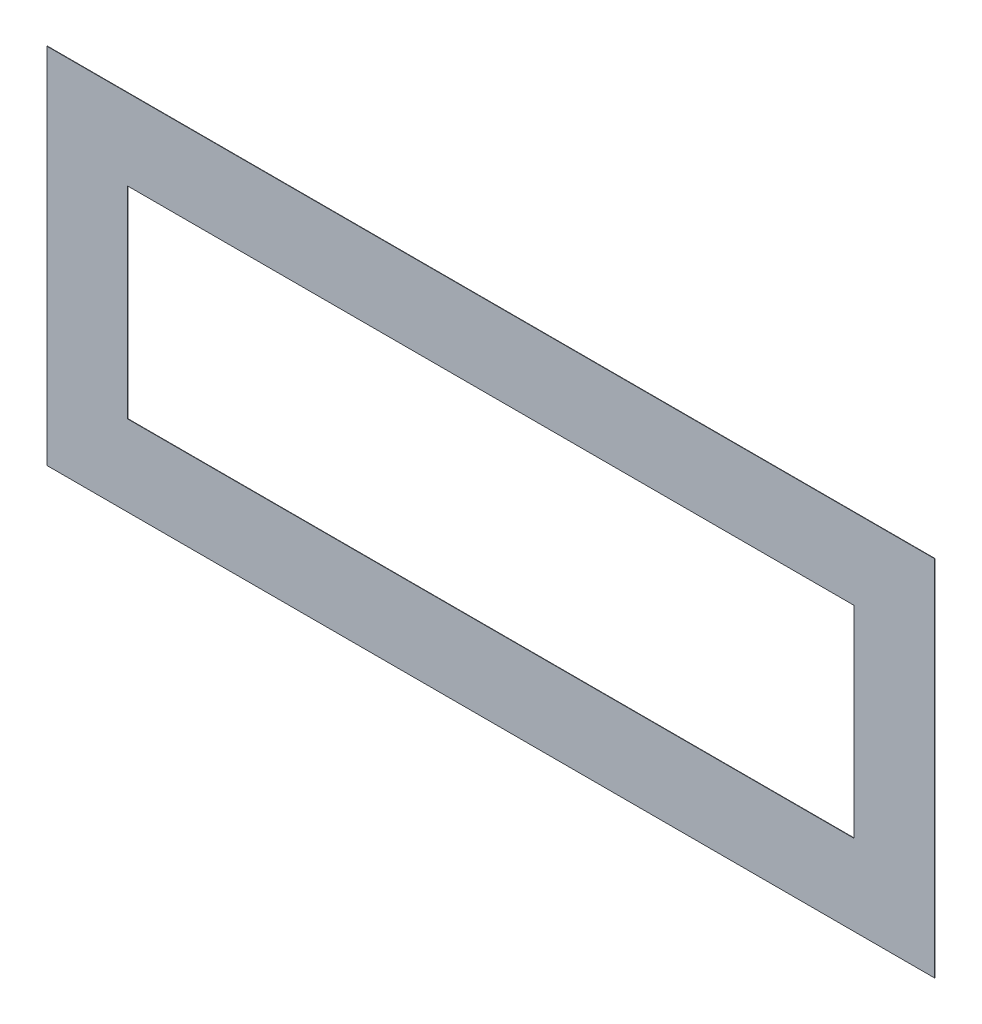
ISO-10303-21;
HEADER;
FILE_DESCRIPTION(('STEP AP214'),'2;1');
FILE_NAME('part.step','',(''),(''),'','','');
FILE_SCHEMA(('AUTOMOTIVE_DESIGN { 1 0 10303 214 1 1 1 1 }'));
ENDSEC;
DATA;
#1=APPLICATION_CONTEXT('core data for automotive mechanical design processes');
#2=APPLICATION_PROTOCOL_DEFINITION('international standard','automotive_design',2000,#1);
#3=PRODUCT_CONTEXT('',#1,'mechanical');
#4=PRODUCT('Part','Part','',(#3));
#5=PRODUCT_RELATED_PRODUCT_CATEGORY('part','',(#4));
#6=PRODUCT_DEFINITION_FORMATION('','',#4);
#7=PRODUCT_DEFINITION_CONTEXT('part definition',#1,'design');
#8=PRODUCT_DEFINITION('design','',#6,#7);
#9=PRODUCT_DEFINITION_SHAPE('','',#8);
#10=(LENGTH_UNIT() NAMED_UNIT(*) SI_UNIT(.MILLI.,.METRE.));
#11=(NAMED_UNIT(*) PLANE_ANGLE_UNIT() SI_UNIT($,.RADIAN.));
#12=(NAMED_UNIT(*) SI_UNIT($,.STERADIAN.) SOLID_ANGLE_UNIT());
#13=UNCERTAINTY_MEASURE_WITH_UNIT(LENGTH_MEASURE(1.E-05),#10,'distance_accuracy_value','');
#14=(GEOMETRIC_REPRESENTATION_CONTEXT(3) GLOBAL_UNCERTAINTY_ASSIGNED_CONTEXT((#13)) GLOBAL_UNIT_ASSIGNED_CONTEXT((#10,
#11,#12)) REPRESENTATION_CONTEXT('',''));
#15=CARTESIAN_POINT('',(0.,0.,0.));
#16=DIRECTION('',(0.,0.,1.));
#17=DIRECTION('',(1.,0.,0.));
#18=AXIS2_PLACEMENT_3D('',#15,#16,#17);
#19=CARTESIAN_POINT('',(0.,0.,0.254));
#20=DIRECTION('',(0.,0.,1.));
#21=DIRECTION('',(1.,0.,0.));
#22=AXIS2_PLACEMENT_3D('',#19,#20,#21);
#23=PLANE('',#22);
#24=DIRECTION('',(0.,1.,0.));
#25=VECTOR('',#24,1.);
#26=CARTESIAN_POINT('',(228.6,-63.5,0.254));
#27=LINE('',#26,#25);
#28=CARTESIAN_POINT('',(228.6,63.5,0.254));
#29=VERTEX_POINT('',#28);
#30=CARTESIAN_POINT('',(228.6,-63.5,0.254));
#31=VERTEX_POINT('',#30);
#32=EDGE_CURVE('E115',#29,#31,#27,.F.);
#33=ORIENTED_EDGE('',*,*,#32,.T.);
#34=DIRECTION('',(1.,0.,0.));
#35=VECTOR('',#34,1.);
#36=CARTESIAN_POINT('',(-228.6,-63.5,0.254));
#37=LINE('',#36,#35);
#38=CARTESIAN_POINT('',(-228.6,-63.5,0.254));
#39=VERTEX_POINT('',#38);
#40=EDGE_CURVE('E120',#31,#39,#37,.F.);
#41=ORIENTED_EDGE('',*,*,#40,.T.);
#42=DIRECTION('',(0.,1.,0.));
#43=VECTOR('',#42,1.);
#44=CARTESIAN_POINT('',(-228.6,63.5,0.254));
#45=LINE('',#44,#43);
#46=CARTESIAN_POINT('',(-228.6,63.5,0.254));
#47=VERTEX_POINT('',#46);
#48=EDGE_CURVE('E123',#39,#47,#45,.T.);
#49=ORIENTED_EDGE('',*,*,#48,.T.);
#50=DIRECTION('',(1.,0.,0.));
#51=VECTOR('',#50,1.);
#52=CARTESIAN_POINT('',(228.6,63.5,0.254));
#53=LINE('',#52,#51);
#54=EDGE_CURVE('E110',#47,#29,#53,.T.);
#55=ORIENTED_EDGE('',*,*,#54,.T.);
#56=EDGE_LOOP('',(#33,#41,#49,#55));
#57=FACE_BOUND('',#56,.T.);
#58=DIRECTION('',(1.,0.,0.));
#59=VECTOR('',#58,1.);
#60=CARTESIAN_POINT('',(-279.400000000013,-114.299999999965,0.254));
#61=LINE('',#60,#59);
#62=CARTESIAN_POINT('',(279.400000000013,-114.299999999965,0.254));
#63=VERTEX_POINT('',#62);
#64=CARTESIAN_POINT('',(-279.400000000013,-114.299999999965,0.254));
#65=VERTEX_POINT('',#64);
#66=EDGE_CURVE('E84',#63,#65,#61,.F.);
#67=ORIENTED_EDGE('',*,*,#66,.F.);
#68=DIRECTION('',(0.,1.,0.));
#69=VECTOR('',#68,1.);
#70=CARTESIAN_POINT('',(279.400000000013,-114.299999999965,0.254));
#71=LINE('',#70,#69);
#72=CARTESIAN_POINT('',(279.400000000013,114.299999999965,0.254));
#73=VERTEX_POINT('',#72);
#74=EDGE_CURVE('E79',#73,#63,#71,.F.);
#75=ORIENTED_EDGE('',*,*,#74,.F.);
#76=DIRECTION('',(1.,0.,0.));
#77=VECTOR('',#76,1.);
#78=CARTESIAN_POINT('',(279.400000000013,114.299999999965,0.254));
#79=LINE('',#78,#77);
#80=CARTESIAN_POINT('',(-279.400000000013,114.299999999965,0.254));
#81=VERTEX_POINT('',#80);
#82=EDGE_CURVE('E94',#81,#73,#79,.T.);
#83=ORIENTED_EDGE('',*,*,#82,.F.);
#84=DIRECTION('',(0.,1.,0.));
#85=VECTOR('',#84,1.);
#86=CARTESIAN_POINT('',(-279.400000000013,114.299999999965,0.254));
#87=LINE('',#86,#85);
#88=EDGE_CURVE('E20',#65,#81,#87,.T.);
#89=ORIENTED_EDGE('',*,*,#88,.F.);
#90=EDGE_LOOP('',(#67,#75,#83,#89));
#91=FACE_BOUND('',#90,.T.);
#92=ADVANCED_FACE('F17',(#57,#91),#23,.T.);
#93=CARTESIAN_POINT('',(-279.400000000013,114.299999999965,0.));
#94=DIRECTION('',(-1.,0.,0.));
#95=DIRECTION('',(0.,0.,1.));
#96=AXIS2_PLACEMENT_3D('',#93,#94,#95);
#97=PLANE('',#96);
#98=ORIENTED_EDGE('',*,*,#88,.T.);
#99=DIRECTION('',(0.,0.,1.));
#100=VECTOR('',#99,1.);
#101=CARTESIAN_POINT('',(-279.400000000013,114.299999999965,0.));
#102=LINE('',#101,#100);
#103=CARTESIAN_POINT('',(-279.400000000013,114.299999999965,0.));
#104=VERTEX_POINT('',#103);
#105=EDGE_CURVE('E105',#104,#81,#102,.T.);
#106=ORIENTED_EDGE('',*,*,#105,.F.);
#107=DIRECTION('',(0.,1.,0.));
#108=VECTOR('',#107,1.);
#109=CARTESIAN_POINT('',(-279.400000000013,0.,0.));
#110=LINE('',#109,#108);
#111=CARTESIAN_POINT('',(-279.400000000013,-114.299999999965,0.));
#112=VERTEX_POINT('',#111);
#113=EDGE_CURVE('E100',#104,#112,#110,.F.);
#114=ORIENTED_EDGE('',*,*,#113,.T.);
#115=DIRECTION('',(0.,0.,-1.));
#116=VECTOR('',#115,1.);
#117=CARTESIAN_POINT('',(-279.400000000013,-114.299999999965,0.));
#118=LINE('',#117,#116);
#119=EDGE_CURVE('E89',#65,#112,#118,.T.);
#120=ORIENTED_EDGE('',*,*,#119,.F.);
#121=EDGE_LOOP('',(#98,#106,#114,#120));
#122=FACE_BOUND('',#121,.T.);
#123=ADVANCED_FACE('F99',(#122),#97,.T.);
#124=CARTESIAN_POINT('',(-279.400000000013,-114.299999999965,0.));
#125=DIRECTION('',(0.,-1.,0.));
#126=DIRECTION('',(0.,0.,-1.));
#127=AXIS2_PLACEMENT_3D('',#124,#125,#126);
#128=PLANE('',#127);
#129=ORIENTED_EDGE('',*,*,#66,.T.);
#130=ORIENTED_EDGE('',*,*,#119,.T.);
#131=DIRECTION('',(1.,0.,0.));
#132=VECTOR('',#131,1.);
#133=CARTESIAN_POINT('',(0.,-114.299999999965,0.));
#134=LINE('',#133,#132);
#135=CARTESIAN_POINT('',(279.400000000013,-114.299999999965,0.));
#136=VERTEX_POINT('',#135);
#137=EDGE_CURVE('E130',#112,#136,#134,.T.);
#138=ORIENTED_EDGE('',*,*,#137,.T.);
#139=DIRECTION('',(0.,0.,-1.));
#140=VECTOR('',#139,1.);
#141=CARTESIAN_POINT('',(279.400000000013,-114.299999999965,0.));
#142=LINE('',#141,#140);
#143=EDGE_CURVE('E91',#63,#136,#142,.T.);
#144=ORIENTED_EDGE('',*,*,#143,.F.);
#145=EDGE_LOOP('',(#129,#130,#138,#144));
#146=FACE_BOUND('',#145,.T.);
#147=ADVANCED_FACE('F86',(#146),#128,.T.);
#148=CARTESIAN_POINT('',(279.400000000013,-114.299999999965,0.));
#149=DIRECTION('',(1.,0.,0.));
#150=DIRECTION('',(0.,0.,-1.));
#151=AXIS2_PLACEMENT_3D('',#148,#149,#150);
#152=PLANE('',#151);
#153=ORIENTED_EDGE('',*,*,#74,.T.);
#154=ORIENTED_EDGE('',*,*,#143,.T.);
#155=DIRECTION('',(0.,1.,0.));
#156=VECTOR('',#155,1.);
#157=CARTESIAN_POINT('',(279.400000000013,0.,0.));
#158=LINE('',#157,#156);
#159=CARTESIAN_POINT('',(279.400000000013,114.299999999965,0.));
#160=VERTEX_POINT('',#159);
#161=EDGE_CURVE('E132',#136,#160,#158,.T.);
#162=ORIENTED_EDGE('',*,*,#161,.T.);
#163=DIRECTION('',(0.,0.,1.));
#164=VECTOR('',#163,1.);
#165=CARTESIAN_POINT('',(279.400000000013,114.299999999965,0.));
#166=LINE('',#165,#164);
#167=EDGE_CURVE('E108',#73,#160,#166,.F.);
#168=ORIENTED_EDGE('',*,*,#167,.F.);
#169=EDGE_LOOP('',(#153,#154,#162,#168));
#170=FACE_BOUND('',#169,.T.);
#171=ADVANCED_FACE('F177',(#170),#152,.T.);
#172=CARTESIAN_POINT('',(279.400000000013,114.299999999965,0.));
#173=DIRECTION('',(0.,1.,0.));
#174=DIRECTION('',(0.,0.,1.));
#175=AXIS2_PLACEMENT_3D('',#172,#173,#174);
#176=PLANE('',#175);
#177=ORIENTED_EDGE('',*,*,#82,.T.);
#178=ORIENTED_EDGE('',*,*,#167,.T.);
#179=DIRECTION('',(1.,0.,0.));
#180=VECTOR('',#179,1.);
#181=CARTESIAN_POINT('',(0.,114.299999999965,0.));
#182=LINE('',#181,#180);
#183=EDGE_CURVE('E135',#160,#104,#182,.F.);
#184=ORIENTED_EDGE('',*,*,#183,.T.);
#185=ORIENTED_EDGE('',*,*,#105,.T.);
#186=EDGE_LOOP('',(#177,#178,#184,#185));
#187=FACE_BOUND('',#186,.T.);
#188=ADVANCED_FACE('F174',(#187),#176,.T.);
#189=CARTESIAN_POINT('',(228.6,63.5,0.));
#190=DIRECTION('',(0.,1.,0.));
#191=DIRECTION('',(0.,0.,1.));
#192=AXIS2_PLACEMENT_3D('',#189,#190,#191);
#193=PLANE('',#192);
#194=DIRECTION('',(0.,0.,-1.));
#195=VECTOR('',#194,1.);
#196=CARTESIAN_POINT('',(228.6,63.5,0.));
#197=LINE('',#196,#195);
#198=CARTESIAN_POINT('',(228.6,63.5,0.));
#199=VERTEX_POINT('',#198);
#200=EDGE_CURVE('E112',#199,#29,#197,.F.);
#201=ORIENTED_EDGE('',*,*,#200,.T.);
#202=ORIENTED_EDGE('',*,*,#54,.F.);
#203=DIRECTION('',(0.,0.,1.));
#204=VECTOR('',#203,1.);
#205=CARTESIAN_POINT('',(-228.6,63.5,0.));
#206=LINE('',#205,#204);
#207=CARTESIAN_POINT('',(-228.6,63.5,0.));
#208=VERTEX_POINT('',#207);
#209=EDGE_CURVE('E126',#47,#208,#206,.F.);
#210=ORIENTED_EDGE('',*,*,#209,.T.);
#211=DIRECTION('',(1.,0.,0.));
#212=VECTOR('',#211,1.);
#213=CARTESIAN_POINT('',(0.,63.5,0.));
#214=LINE('',#213,#212);
#215=EDGE_CURVE('E138',#208,#199,#214,.T.);
#216=ORIENTED_EDGE('',*,*,#215,.T.);
#217=EDGE_LOOP('',(#201,#202,#210,#216));
#218=FACE_BOUND('',#217,.T.);
#219=ADVANCED_FACE('F157',(#218),#193,.F.);
#220=CARTESIAN_POINT('',(228.6,-63.5,0.));
#221=DIRECTION('',(1.,0.,0.));
#222=DIRECTION('',(0.,0.,-1.));
#223=AXIS2_PLACEMENT_3D('',#220,#221,#222);
#224=PLANE('',#223);
#225=DIRECTION('',(0.,0.,-1.));
#226=VECTOR('',#225,1.);
#227=CARTESIAN_POINT('',(228.6,-63.5,0.));
#228=LINE('',#227,#226);
#229=CARTESIAN_POINT('',(228.6,-63.5,0.));
#230=VERTEX_POINT('',#229);
#231=EDGE_CURVE('E117',#230,#31,#228,.F.);
#232=ORIENTED_EDGE('',*,*,#231,.T.);
#233=ORIENTED_EDGE('',*,*,#32,.F.);
#234=ORIENTED_EDGE('',*,*,#200,.F.);
#235=DIRECTION('',(0.,1.,0.));
#236=VECTOR('',#235,1.);
#237=CARTESIAN_POINT('',(228.6,0.,0.));
#238=LINE('',#237,#236);
#239=EDGE_CURVE('E141',#199,#230,#238,.F.);
#240=ORIENTED_EDGE('',*,*,#239,.T.);
#241=EDGE_LOOP('',(#232,#233,#234,#240));
#242=FACE_BOUND('',#241,.T.);
#243=ADVANCED_FACE('F154',(#242),#224,.F.);
#244=CARTESIAN_POINT('',(-228.6,-63.5,0.));
#245=DIRECTION('',(0.,-1.,0.));
#246=DIRECTION('',(0.,0.,-1.));
#247=AXIS2_PLACEMENT_3D('',#244,#245,#246);
#248=PLANE('',#247);
#249=DIRECTION('',(0.,0.,1.));
#250=VECTOR('',#249,1.);
#251=CARTESIAN_POINT('',(-228.6,-63.5,0.));
#252=LINE('',#251,#250);
#253=CARTESIAN_POINT('',(-228.6,-63.5,0.));
#254=VERTEX_POINT('',#253);
#255=EDGE_CURVE('E34',#254,#39,#252,.T.);
#256=ORIENTED_EDGE('',*,*,#255,.T.);
#257=ORIENTED_EDGE('',*,*,#40,.F.);
#258=ORIENTED_EDGE('',*,*,#231,.F.);
#259=DIRECTION('',(1.,0.,0.));
#260=VECTOR('',#259,1.);
#261=CARTESIAN_POINT('',(0.,-63.5,0.));
#262=LINE('',#261,#260);
#263=EDGE_CURVE('E26',#230,#254,#262,.F.);
#264=ORIENTED_EDGE('',*,*,#263,.T.);
#265=EDGE_LOOP('',(#256,#257,#258,#264));
#266=FACE_BOUND('',#265,.T.);
#267=ADVANCED_FACE('F147',(#266),#248,.F.);
#268=CARTESIAN_POINT('',(-228.6,63.5,0.));
#269=DIRECTION('',(-1.,0.,0.));
#270=DIRECTION('',(0.,0.,1.));
#271=AXIS2_PLACEMENT_3D('',#268,#269,#270);
#272=PLANE('',#271);
#273=ORIENTED_EDGE('',*,*,#209,.F.);
#274=ORIENTED_EDGE('',*,*,#48,.F.);
#275=ORIENTED_EDGE('',*,*,#255,.F.);
#276=DIRECTION('',(0.,1.,0.));
#277=VECTOR('',#276,1.);
#278=CARTESIAN_POINT('',(-228.6,0.,0.));
#279=LINE('',#278,#277);
#280=EDGE_CURVE('E11',#254,#208,#279,.T.);
#281=ORIENTED_EDGE('',*,*,#280,.T.);
#282=EDGE_LOOP('',(#273,#274,#275,#281));
#283=FACE_BOUND('',#282,.T.);
#284=ADVANCED_FACE('F159',(#283),#272,.F.);
#285=CARTESIAN_POINT('',(0.,0.,0.));
#286=DIRECTION('',(0.,0.,1.));
#287=DIRECTION('',(1.,0.,0.));
#288=AXIS2_PLACEMENT_3D('',#285,#286,#287);
#289=PLANE('',#288);
#290=ORIENTED_EDGE('',*,*,#263,.F.);
#291=ORIENTED_EDGE('',*,*,#239,.F.);
#292=ORIENTED_EDGE('',*,*,#215,.F.);
#293=ORIENTED_EDGE('',*,*,#280,.F.);
#294=EDGE_LOOP('',(#290,#291,#292,#293));
#295=FACE_BOUND('',#294,.T.);
#296=ORIENTED_EDGE('',*,*,#161,.F.);
#297=ORIENTED_EDGE('',*,*,#137,.F.);
#298=ORIENTED_EDGE('',*,*,#113,.F.);
#299=ORIENTED_EDGE('',*,*,#183,.F.);
#300=EDGE_LOOP('',(#296,#297,#298,#299));
#301=FACE_BOUND('',#300,.T.);
#302=ADVANCED_FACE('F151',(#295,#301),#289,.F.);
#303=CLOSED_SHELL('',(#92,#123,#147,#171,#188,#219,#243,#267,#284,#302));
#304=MANIFOLD_SOLID_BREP('B1',#303);
#305=ADVANCED_BREP_SHAPE_REPRESENTATION('',(#18,#304),#14);
#306=SHAPE_DEFINITION_REPRESENTATION(#9,#305);
ENDSEC;
END-ISO-10303-21;
